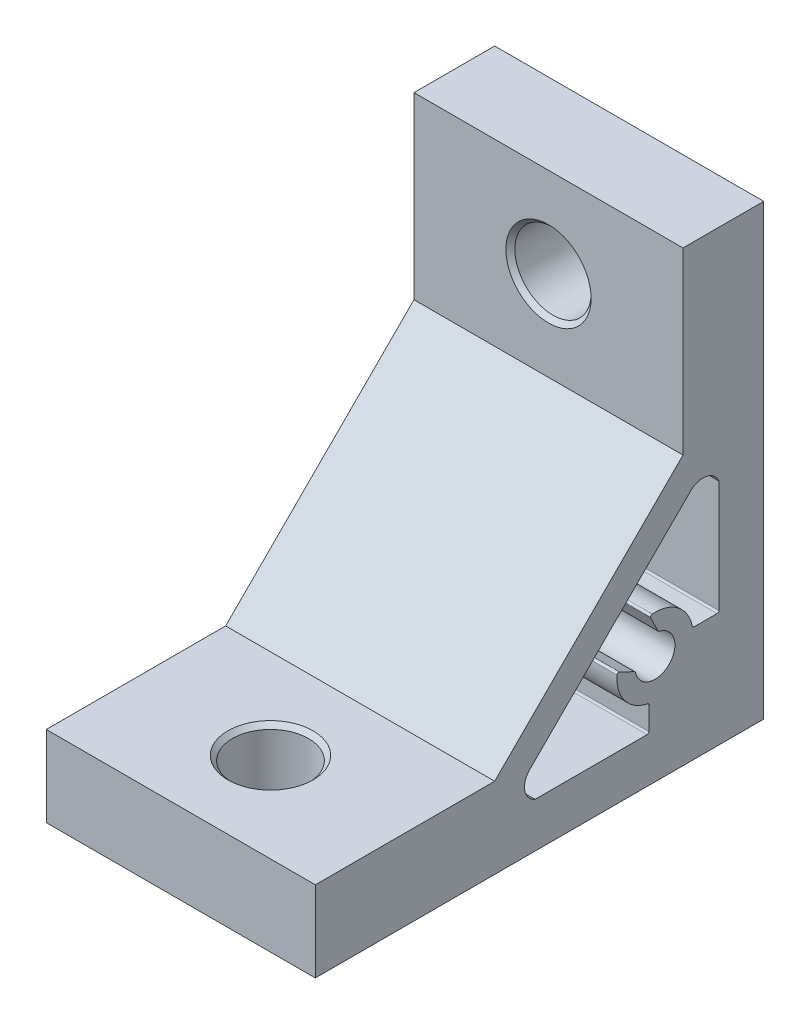
ISO-10303-21;
HEADER;
FILE_DESCRIPTION(('STEP AP214'),'2;1');
FILE_NAME('part.step','',(''),(''),'','','');
FILE_SCHEMA(('AUTOMOTIVE_DESIGN { 1 0 10303 214 1 1 1 1 }'));
ENDSEC;
DATA;
#1=APPLICATION_CONTEXT('core data for automotive mechanical design processes');
#2=APPLICATION_PROTOCOL_DEFINITION('international standard','automotive_design',2000,#1);
#3=PRODUCT_CONTEXT('',#1,'mechanical');
#4=PRODUCT('Part','Part','',(#3));
#5=PRODUCT_RELATED_PRODUCT_CATEGORY('part','',(#4));
#6=PRODUCT_DEFINITION_FORMATION('','',#4);
#7=PRODUCT_DEFINITION_CONTEXT('part definition',#1,'design');
#8=PRODUCT_DEFINITION('design','',#6,#7);
#9=PRODUCT_DEFINITION_SHAPE('','',#8);
#10=(LENGTH_UNIT() NAMED_UNIT(*) SI_UNIT(.MILLI.,.METRE.));
#11=(NAMED_UNIT(*) PLANE_ANGLE_UNIT() SI_UNIT($,.RADIAN.));
#12=(NAMED_UNIT(*) SI_UNIT($,.STERADIAN.) SOLID_ANGLE_UNIT());
#13=UNCERTAINTY_MEASURE_WITH_UNIT(LENGTH_MEASURE(1.E-05),#10,'distance_accuracy_value','');
#14=(GEOMETRIC_REPRESENTATION_CONTEXT(3) GLOBAL_UNCERTAINTY_ASSIGNED_CONTEXT((#13)) GLOBAL_UNIT_ASSIGNED_CONTEXT((#10,
#11,#12)) REPRESENTATION_CONTEXT('',''));
#15=CARTESIAN_POINT('',(0.,0.,0.));
#16=DIRECTION('',(0.,0.,1.));
#17=DIRECTION('',(1.,0.,0.));
#18=AXIS2_PLACEMENT_3D('',#15,#16,#17);
#19=CARTESIAN_POINT('',(15.730337766214,-14.5646423427639,24.6997902439944));
#20=DIRECTION('',(0.,0.,-1.));
#21=DIRECTION('',(0.,1.,0.));
#22=AXIS2_PLACEMENT_3D('',#19,#20,#21);
#23=PLANE('',#22);
#24=DIRECTION('',(0.,-1.,0.));
#25=VECTOR('',#24,1.);
#26=CARTESIAN_POINT('',(-14.269662233786,-14.5646423427639,24.6997902439944));
#27=LINE('',#26,#25);
#28=CARTESIAN_POINT('',(-14.269662233786,-14.5646423427639,24.6997902439944));
#29=VERTEX_POINT('',#28);
#30=CARTESIAN_POINT('',(-14.269662233786,-23.5646423427639,24.6997902439944));
#31=VERTEX_POINT('',#30);
#32=EDGE_CURVE('E280',#29,#31,#27,.T.);
#33=ORIENTED_EDGE('',*,*,#32,.T.);
#34=DIRECTION('',(-1.,0.,0.));
#35=VECTOR('',#34,1.);
#36=CARTESIAN_POINT('',(15.730337766214,-23.5646423427639,24.6997902439944));
#37=LINE('',#36,#35);
#38=CARTESIAN_POINT('',(15.730337766214,-23.5646423427639,24.6997902439944));
#39=VERTEX_POINT('',#38);
#40=EDGE_CURVE('E331',#39,#31,#37,.T.);
#41=ORIENTED_EDGE('',*,*,#40,.F.);
#42=DIRECTION('',(0.,-1.,0.));
#43=VECTOR('',#42,1.);
#44=CARTESIAN_POINT('',(15.730337766214,-14.5646423427639,24.6997902439944));
#45=LINE('',#44,#43);
#46=CARTESIAN_POINT('',(15.730337766214,-14.5646423427639,24.6997902439944));
#47=VERTEX_POINT('',#46);
#48=EDGE_CURVE('E284',#47,#39,#45,.T.);
#49=ORIENTED_EDGE('',*,*,#48,.F.);
#50=DIRECTION('',(-1.,0.,0.));
#51=VECTOR('',#50,1.);
#52=CARTESIAN_POINT('',(15.730337766214,-14.5646423427639,24.6997902439944));
#53=LINE('',#52,#51);
#54=EDGE_CURVE('E300',#47,#29,#53,.T.);
#55=ORIENTED_EDGE('',*,*,#54,.T.);
#56=EDGE_LOOP('',(#33,#41,#49,#55));
#57=FACE_BOUND('',#56,.T.);
#58=ADVANCED_FACE('F16',(#57),#23,.F.);
#59=CARTESIAN_POINT('',(15.730337766214,-23.5646423427639,24.6997902439944));
#60=DIRECTION('',(0.,1.,0.));
#61=DIRECTION('',(0.,0.,1.));
#62=AXIS2_PLACEMENT_3D('',#59,#60,#61);
#63=PLANE('',#62);
#64=CARTESIAN_POINT('',(0.73033776621401,-23.5646423427639,14.6997902439944));
#65=DIRECTION('',(0.,1.,0.));
#66=DIRECTION('',(0.,0.,1.));
#67=AXIS2_PLACEMENT_3D('',#64,#65,#66);
#68=CIRCLE('',#67,4.74999999999998);
#69=CARTESIAN_POINT('',(0.73033776621401,-23.5646423427639,19.4497902439943));
#70=VERTEX_POINT('',#69);
#71=EDGE_CURVE('E334',#70,#70,#68,.T.);
#72=ORIENTED_EDGE('',*,*,#71,.T.);
#73=EDGE_LOOP('',(#72));
#74=FACE_BOUND('',#73,.T.);
#75=DIRECTION('',(0.,0.,-1.));
#76=VECTOR('',#75,1.);
#77=CARTESIAN_POINT('',(-14.269662233786,-23.5646423427639,24.6997902439944));
#78=LINE('',#77,#76);
#79=CARTESIAN_POINT('',(-14.269662233786,-23.5646423427639,-25.3002097560056));
#80=VERTEX_POINT('',#79);
#81=EDGE_CURVE('E303',#31,#80,#78,.T.);
#82=ORIENTED_EDGE('',*,*,#81,.T.);
#83=DIRECTION('',(-1.,0.,0.));
#84=VECTOR('',#83,1.);
#85=CARTESIAN_POINT('',(15.730337766214,-23.5646423427639,-25.3002097560056));
#86=LINE('',#85,#84);
#87=CARTESIAN_POINT('',(15.730337766214,-23.5646423427639,-25.3002097560056));
#88=VERTEX_POINT('',#87);
#89=EDGE_CURVE('E328',#88,#80,#86,.T.);
#90=ORIENTED_EDGE('',*,*,#89,.F.);
#91=DIRECTION('',(0.,0.,-1.));
#92=VECTOR('',#91,1.);
#93=CARTESIAN_POINT('',(15.730337766214,-23.5646423427639,24.6997902439944));
#94=LINE('',#93,#92);
#95=EDGE_CURVE('E287',#39,#88,#94,.T.);
#96=ORIENTED_EDGE('',*,*,#95,.F.);
#97=ORIENTED_EDGE('',*,*,#40,.T.);
#98=EDGE_LOOP('',(#82,#90,#96,#97));
#99=FACE_BOUND('',#98,.T.);
#100=ADVANCED_FACE('F504',(#74,#99),#63,.F.);
#101=CARTESIAN_POINT('',(15.730337766214,-23.5646423427639,-25.3002097560056));
#102=DIRECTION('',(0.,0.,1.));
#103=DIRECTION('',(0.,-1.,0.));
#104=AXIS2_PLACEMENT_3D('',#101,#102,#103);
#105=PLANE('',#104);
#106=CARTESIAN_POINT('',(0.730337766214012,16.4353576572361,-25.3002097560056));
#107=DIRECTION('',(0.,0.,1.));
#108=DIRECTION('',(0.,-1.,0.));
#109=AXIS2_PLACEMENT_3D('',#106,#107,#108);
#110=CIRCLE('',#109,4.74999999999999);
#111=CARTESIAN_POINT('',(0.730337766214012,11.6853576572361,-25.3002097560056));
#112=VERTEX_POINT('',#111);
#113=EDGE_CURVE('E343',#112,#112,#110,.T.);
#114=ORIENTED_EDGE('',*,*,#113,.T.);
#115=EDGE_LOOP('',(#114));
#116=FACE_BOUND('',#115,.T.);
#117=DIRECTION('',(0.,1.,0.));
#118=VECTOR('',#117,1.);
#119=CARTESIAN_POINT('',(-14.269662233786,-23.5646423427639,-25.3002097560056));
#120=LINE('',#119,#118);
#121=CARTESIAN_POINT('',(-14.269662233786,26.4353576572361,-25.3002097560056));
#122=VERTEX_POINT('',#121);
#123=EDGE_CURVE('E305',#80,#122,#120,.T.);
#124=ORIENTED_EDGE('',*,*,#123,.T.);
#125=DIRECTION('',(-1.,0.,0.));
#126=VECTOR('',#125,1.);
#127=CARTESIAN_POINT('',(15.730337766214,26.4353576572361,-25.3002097560056));
#128=LINE('',#127,#126);
#129=CARTESIAN_POINT('',(15.730337766214,26.4353576572361,-25.3002097560056));
#130=VERTEX_POINT('',#129);
#131=EDGE_CURVE('E325',#130,#122,#128,.T.);
#132=ORIENTED_EDGE('',*,*,#131,.F.);
#133=DIRECTION('',(0.,1.,0.));
#134=VECTOR('',#133,1.);
#135=CARTESIAN_POINT('',(15.730337766214,-23.5646423427639,-25.3002097560056));
#136=LINE('',#135,#134);
#137=EDGE_CURVE('E290',#88,#130,#136,.T.);
#138=ORIENTED_EDGE('',*,*,#137,.F.);
#139=ORIENTED_EDGE('',*,*,#89,.T.);
#140=EDGE_LOOP('',(#124,#132,#138,#139));
#141=FACE_BOUND('',#140,.T.);
#142=ADVANCED_FACE('F510',(#116,#141),#105,.F.);
#143=CARTESIAN_POINT('',(15.730337766214,26.4353576572361,-25.3002097560056));
#144=DIRECTION('',(0.,-1.,0.));
#145=DIRECTION('',(0.,0.,-1.));
#146=AXIS2_PLACEMENT_3D('',#143,#144,#145);
#147=PLANE('',#146);
#148=DIRECTION('',(0.,0.,1.));
#149=VECTOR('',#148,1.);
#150=CARTESIAN_POINT('',(-14.269662233786,26.4353576572361,-25.3002097560056));
#151=LINE('',#150,#149);
#152=CARTESIAN_POINT('',(-14.269662233786,26.4353576572361,-16.3002097560056));
#153=VERTEX_POINT('',#152);
#154=EDGE_CURVE('E307',#122,#153,#151,.T.);
#155=ORIENTED_EDGE('',*,*,#154,.T.);
#156=DIRECTION('',(-1.,0.,0.));
#157=VECTOR('',#156,1.);
#158=CARTESIAN_POINT('',(15.730337766214,26.4353576572361,-16.3002097560056));
#159=LINE('',#158,#157);
#160=CARTESIAN_POINT('',(15.730337766214,26.4353576572361,-16.3002097560056));
#161=VERTEX_POINT('',#160);
#162=EDGE_CURVE('E322',#161,#153,#159,.T.);
#163=ORIENTED_EDGE('',*,*,#162,.F.);
#164=DIRECTION('',(0.,0.,1.));
#165=VECTOR('',#164,1.);
#166=CARTESIAN_POINT('',(15.730337766214,26.4353576572361,-25.3002097560056));
#167=LINE('',#166,#165);
#168=EDGE_CURVE('E292',#130,#161,#167,.T.);
#169=ORIENTED_EDGE('',*,*,#168,.F.);
#170=ORIENTED_EDGE('',*,*,#131,.T.);
#171=EDGE_LOOP('',(#155,#163,#169,#170));
#172=FACE_BOUND('',#171,.T.);
#173=ADVANCED_FACE('F753',(#172),#147,.F.);
#174=CARTESIAN_POINT('',(15.730337766214,26.4353576572361,-16.3002097560056));
#175=DIRECTION('',(0.,0.,-1.));
#176=DIRECTION('',(0.,1.,0.));
#177=AXIS2_PLACEMENT_3D('',#174,#175,#176);
#178=PLANE('',#177);
#179=CARTESIAN_POINT('',(0.730337766214012,16.4353576572361,-16.3002097560056));
#180=DIRECTION('',(0.,0.,-1.));
#181=DIRECTION('',(0.,1.,0.));
#182=AXIS2_PLACEMENT_3D('',#179,#180,#181);
#183=CIRCLE('',#182,4.75000000000004);
#184=CARTESIAN_POINT('',(0.730337766214012,21.1853576572362,-16.3002097560056));
#185=VERTEX_POINT('',#184);
#186=EDGE_CURVE('E355',#185,#185,#183,.T.);
#187=ORIENTED_EDGE('',*,*,#186,.T.);
#188=EDGE_LOOP('',(#187));
#189=FACE_BOUND('',#188,.T.);
#190=DIRECTION('',(0.,-1.,0.));
#191=VECTOR('',#190,1.);
#192=CARTESIAN_POINT('',(-14.269662233786,26.4353576572361,-16.3002097560056));
#193=LINE('',#192,#191);
#194=CARTESIAN_POINT('',(-14.269662233786,6.43535765723613,-16.3002097560056));
#195=VERTEX_POINT('',#194);
#196=EDGE_CURVE('E309',#153,#195,#193,.T.);
#197=ORIENTED_EDGE('',*,*,#196,.T.);
#198=DIRECTION('',(-1.,0.,0.));
#199=VECTOR('',#198,1.);
#200=CARTESIAN_POINT('',(15.730337766214,6.43535765723613,-16.3002097560056));
#201=LINE('',#200,#199);
#202=CARTESIAN_POINT('',(15.730337766214,6.43535765723613,-16.3002097560056));
#203=VERTEX_POINT('',#202);
#204=EDGE_CURVE('E319',#203,#195,#201,.T.);
#205=ORIENTED_EDGE('',*,*,#204,.F.);
#206=DIRECTION('',(0.,-1.,0.));
#207=VECTOR('',#206,1.);
#208=CARTESIAN_POINT('',(15.730337766214,26.4353576572361,-16.3002097560056));
#209=LINE('',#208,#207);
#210=EDGE_CURVE('E294',#161,#203,#209,.T.);
#211=ORIENTED_EDGE('',*,*,#210,.F.);
#212=ORIENTED_EDGE('',*,*,#162,.T.);
#213=EDGE_LOOP('',(#197,#205,#211,#212));
#214=FACE_BOUND('',#213,.T.);
#215=ADVANCED_FACE('F744',(#189,#214),#178,.F.);
#216=CARTESIAN_POINT('',(15.730337766214,6.43535765723613,-16.3002097560056));
#217=DIRECTION('',(0.,-0.707106781186547,-0.707106781186548));
#218=DIRECTION('',(0.,0.707106781186548,-0.707106781186547));
#219=AXIS2_PLACEMENT_3D('',#216,#217,#218);
#220=PLANE('',#219);
#221=DIRECTION('',(0.,-0.707106781186548,0.707106781186547));
#222=VECTOR('',#221,1.);
#223=CARTESIAN_POINT('',(-14.269662233786,6.43535765723613,-16.3002097560056));
#224=LINE('',#223,#222);
#225=CARTESIAN_POINT('',(-14.269662233786,-14.5646423427639,4.69979024399435));
#226=VERTEX_POINT('',#225);
#227=EDGE_CURVE('E311',#195,#226,#224,.T.);
#228=ORIENTED_EDGE('',*,*,#227,.T.);
#229=DIRECTION('',(-1.,0.,0.));
#230=VECTOR('',#229,1.);
#231=CARTESIAN_POINT('',(15.730337766214,-14.5646423427639,4.69979024399435));
#232=LINE('',#231,#230);
#233=CARTESIAN_POINT('',(15.730337766214,-14.5646423427639,4.69979024399435));
#234=VERTEX_POINT('',#233);
#235=EDGE_CURVE('E316',#234,#226,#232,.T.);
#236=ORIENTED_EDGE('',*,*,#235,.F.);
#237=DIRECTION('',(0.,-0.707106781186548,0.707106781186547));
#238=VECTOR('',#237,1.);
#239=CARTESIAN_POINT('',(15.730337766214,6.43535765723613,-16.3002097560056));
#240=LINE('',#239,#238);
#241=EDGE_CURVE('E296',#203,#234,#240,.T.);
#242=ORIENTED_EDGE('',*,*,#241,.F.);
#243=ORIENTED_EDGE('',*,*,#204,.T.);
#244=EDGE_LOOP('',(#228,#236,#242,#243));
#245=FACE_BOUND('',#244,.T.);
#246=ADVANCED_FACE('F735',(#245),#220,.F.);
#247=CARTESIAN_POINT('',(15.730337766214,-14.5646423427639,4.69979024399435));
#248=DIRECTION('',(0.,-1.,0.));
#249=DIRECTION('',(0.,0.,-1.));
#250=AXIS2_PLACEMENT_3D('',#247,#248,#249);
#251=PLANE('',#250);
#252=CARTESIAN_POINT('',(0.73033776621401,-14.5646423427639,14.6997902439944));
#253=DIRECTION('',(0.,-1.,0.));
#254=DIRECTION('',(0.,0.,-1.));
#255=AXIS2_PLACEMENT_3D('',#252,#253,#254);
#256=CIRCLE('',#255,4.74999999999999);
#257=CARTESIAN_POINT('',(0.73033776621401,-14.5646423427639,9.94979024399436));
#258=VERTEX_POINT('',#257);
#259=EDGE_CURVE('E352',#258,#258,#256,.T.);
#260=ORIENTED_EDGE('',*,*,#259,.T.);
#261=EDGE_LOOP('',(#260));
#262=FACE_BOUND('',#261,.T.);
#263=DIRECTION('',(0.,0.,1.));
#264=VECTOR('',#263,1.);
#265=CARTESIAN_POINT('',(-14.269662233786,-14.5646423427639,4.69979024399435));
#266=LINE('',#265,#264);
#267=EDGE_CURVE('E288',#226,#29,#266,.T.);
#268=ORIENTED_EDGE('',*,*,#267,.T.);
#269=ORIENTED_EDGE('',*,*,#54,.F.);
#270=DIRECTION('',(0.,0.,1.));
#271=VECTOR('',#270,1.);
#272=CARTESIAN_POINT('',(15.730337766214,-14.5646423427639,4.69979024399435));
#273=LINE('',#272,#271);
#274=EDGE_CURVE('E298',#234,#47,#273,.T.);
#275=ORIENTED_EDGE('',*,*,#274,.F.);
#276=ORIENTED_EDGE('',*,*,#235,.T.);
#277=EDGE_LOOP('',(#268,#269,#275,#276));
#278=FACE_BOUND('',#277,.T.);
#279=ADVANCED_FACE('F727',(#262,#278),#251,.F.);
#280=CARTESIAN_POINT('',(15.730337766214,-23.5646423427639,-0.300209756005643));
#281=DIRECTION('',(1.,0.,0.));
#282=DIRECTION('',(0.,0.,-1.));
#283=AXIS2_PLACEMENT_3D('',#280,#281,#282);
#284=PLANE('',#283);
#285=DIRECTION('',(0.,-0.441188575542835,-0.897414419769642));
#286=VECTOR('',#285,1.);
#287=CARTESIAN_POINT('',(15.730337766214,-11.8278844515461,-10.982512113457));
#288=LINE('',#287,#286);
#289=CARTESIAN_POINT('',(15.730337766214,-10.9623868313826,-9.22201764993785));
#290=VERTEX_POINT('',#289);
#291=CARTESIAN_POINT('',(15.730337766214,-11.7843981004198,-10.8940572423944));
#292=VERTEX_POINT('',#291);
#293=EDGE_CURVE('E265',#290,#292,#288,.T.);
#294=ORIENTED_EDGE('',*,*,#293,.F.);
#295=CARTESIAN_POINT('',(15.730337766214,-11.1418697153365,-9.13377993482929));
#296=DIRECTION('',(1.,0.,0.));
#297=DIRECTION('',(0.,0.,-1.));
#298=AXIS2_PLACEMENT_3D('',#295,#296,#297);
#299=CIRCLE('',#298,0.2);
#300=CARTESIAN_POINT('',(15.730337766214,-11.1272749074084,-8.93431316671605));
#301=VERTEX_POINT('',#300);
#302=EDGE_CURVE('E389',#290,#301,#299,.T.);
#303=ORIENTED_EDGE('',*,*,#302,.T.);
#304=CARTESIAN_POINT('',(15.730337766214,-11.4374145758807,-13.1729819891224));
#305=DIRECTION('',(-1.,0.,0.));
#306=DIRECTION('',(0.,0.,-1.));
#307=AXIS2_PLACEMENT_3D('',#304,#305,#306);
#308=CIRCLE('',#307,4.25);
#309=CARTESIAN_POINT('',(15.730337766214,-15.605844136095,-12.344311366057));
#310=VERTEX_POINT('',#309);
#311=EDGE_CURVE('E262',#310,#301,#308,.T.);
#312=ORIENTED_EDGE('',*,*,#311,.F.);
#313=CARTESIAN_POINT('',(15.730337766214,-15.8020055271639,-12.3053151014422));
#314=DIRECTION('',(1.,0.,0.));
#315=DIRECTION('',(0.,0.,-1.));
#316=AXIS2_PLACEMENT_3D('',#313,#314,#315);
#317=CIRCLE('',#316,0.2);
#318=CARTESIAN_POINT('',(15.730337766214,-15.8020055271639,-12.5053151014422));
#319=VERTEX_POINT('',#318);
#320=EDGE_CURVE('E420',#310,#319,#317,.F.);
#321=ORIENTED_EDGE('',*,*,#320,.T.);
#322=DIRECTION('',(0.,1.,0.));
#323=VECTOR('',#322,1.);
#324=CARTESIAN_POINT('',(15.730337766214,-18.5646423427639,-12.5053151014422));
#325=LINE('',#324,#323);
#326=CARTESIAN_POINT('',(15.730337766214,-18.3646423427639,-12.5053151014422));
#327=VERTEX_POINT('',#326);
#328=EDGE_CURVE('E259',#327,#319,#325,.T.);
#329=ORIENTED_EDGE('',*,*,#328,.F.);
#330=CARTESIAN_POINT('',(15.730337766214,-18.3646423427639,-12.3053151014422));
#331=DIRECTION('',(1.,0.,0.));
#332=DIRECTION('',(0.,0.,-1.));
#333=AXIS2_PLACEMENT_3D('',#330,#331,#332);
#334=CIRCLE('',#333,0.2);
#335=CARTESIAN_POINT('',(15.730337766214,-18.5646423427639,-12.3053151014422));
#336=VERTEX_POINT('',#335);
#337=EDGE_CURVE('E416',#327,#336,#334,.F.);
#338=ORIENTED_EDGE('',*,*,#337,.T.);
#339=DIRECTION('',(0.,0.,-1.));
#340=VECTOR('',#339,1.);
#341=CARTESIAN_POINT('',(15.730337766214,-18.5646423427639,0.194684898557791));
#342=LINE('',#341,#340);
#343=CARTESIAN_POINT('',(15.730337766214,-18.5646423427639,0.194684898557796));
#344=VERTEX_POINT('',#343);
#345=EDGE_CURVE('E256',#344,#336,#342,.T.);
#346=ORIENTED_EDGE('',*,*,#345,.F.);
#347=CARTESIAN_POINT('',(15.730337766214,-16.7817970669112,-0.556852238014705));
#348=DIRECTION('',(1.,0.,0.));
#349=DIRECTION('',(0.,0.,-1.));
#350=AXIS2_PLACEMENT_3D('',#347,#348,#349);
#351=CIRCLE('',#350,1.93477268568628);
#352=CARTESIAN_POINT('',(15.730337766214,-15.413706180808,0.811238648088585));
#353=VERTEX_POINT('',#352);
#354=EDGE_CURVE('E253',#353,#344,#351,.T.);
#355=ORIENTED_EDGE('',*,*,#354,.F.);
#356=DIRECTION('',(0.,-0.707106781186547,0.707106781186548));
#357=VECTOR('',#356,1.);
#358=CARTESIAN_POINT('',(15.730337766214,-15.413706180808,0.811238648088585));
#359=LINE('',#358,#357);
#360=CARTESIAN_POINT('',(15.730337766214,2.54680606133035,-17.1492735940497));
#361=VERTEX_POINT('',#360);
#362=EDGE_CURVE('E251',#361,#353,#359,.T.);
#363=ORIENTED_EDGE('',*,*,#362,.F.);
#364=CARTESIAN_POINT('',(15.730337766214,1.17871517522708,-18.517364480153));
#365=DIRECTION('',(1.,0.,0.));
#366=DIRECTION('',(0.,0.,1.));
#367=AXIS2_PLACEMENT_3D('',#364,#365,#366);
#368=CIRCLE('',#367,1.93477268568627);
#369=CARTESIAN_POINT('',(15.730337766214,1.93025231179957,-20.3002097560056));
#370=VERTEX_POINT('',#369);
#371=EDGE_CURVE('E203',#370,#361,#368,.T.);
#372=ORIENTED_EDGE('',*,*,#371,.F.);
#373=DIRECTION('',(0.,1.,0.));
#374=VECTOR('',#373,1.);
#375=CARTESIAN_POINT('',(15.730337766214,1.93025231179957,-20.3002097560056));
#376=LINE('',#375,#374);
#377=CARTESIAN_POINT('',(15.730337766214,-10.5697476882004,-20.3002097560056));
#378=VERTEX_POINT('',#377);
#379=EDGE_CURVE('E222',#378,#370,#376,.T.);
#380=ORIENTED_EDGE('',*,*,#379,.F.);
#381=CARTESIAN_POINT('',(15.730337766214,-10.5697476882004,-20.1002097560056));
#382=DIRECTION('',(1.,0.,0.));
#383=DIRECTION('',(0.,0.,-1.));
#384=AXIS2_PLACEMENT_3D('',#381,#382,#383);
#385=CIRCLE('',#384,0.2);
#386=CARTESIAN_POINT('',(15.730337766214,-10.7697476882004,-20.1002097560056));
#387=VERTEX_POINT('',#386);
#388=EDGE_CURVE('E412',#378,#387,#385,.F.);
#389=ORIENTED_EDGE('',*,*,#388,.T.);
#390=DIRECTION('',(0.,0.,-1.));
#391=VECTOR('',#390,1.);
#392=CARTESIAN_POINT('',(15.730337766214,-10.7697476882004,-20.3002097560056));
#393=LINE('',#392,#391);
#394=CARTESIAN_POINT('',(15.730337766214,-10.7697476882004,-17.5375729404056));
#395=VERTEX_POINT('',#394);
#396=EDGE_CURVE('E224',#395,#387,#393,.T.);
#397=ORIENTED_EDGE('',*,*,#396,.F.);
#398=CARTESIAN_POINT('',(15.730337766214,-10.5697476882004,-17.5375729404056));
#399=DIRECTION('',(1.,0.,0.));
#400=DIRECTION('',(0.,0.,-1.));
#401=AXIS2_PLACEMENT_3D('',#398,#399,#400);
#402=CIRCLE('',#401,0.2);
#403=CARTESIAN_POINT('',(15.730337766214,-10.6087439528153,-17.3414115493367));
#404=VERTEX_POINT('',#403);
#405=EDGE_CURVE('E24',#395,#404,#402,.F.);
#406=ORIENTED_EDGE('',*,*,#405,.T.);
#407=CARTESIAN_POINT('',(15.730337766214,-11.4374145758807,-13.1729819891224));
#408=DIRECTION('',(-1.,0.,0.));
#409=DIRECTION('',(0.,0.,-1.));
#410=AXIS2_PLACEMENT_3D('',#407,#408,#409);
#411=CIRCLE('',#410,4.25);
#412=CARTESIAN_POINT('',(15.730337766214,-7.19874575347427,-12.8628423206502));
#413=VERTEX_POINT('',#412);
#414=EDGE_CURVE('E274',#413,#404,#411,.T.);
#415=ORIENTED_EDGE('',*,*,#414,.F.);
#416=CARTESIAN_POINT('',(15.730337766214,-7.39821252158751,-12.8774371285783));
#417=DIRECTION('',(1.,0.,0.));
#418=DIRECTION('',(0.,0.,-1.));
#419=AXIS2_PLACEMENT_3D('',#416,#417,#418);
#420=CIRCLE('',#419,0.2);
#421=CARTESIAN_POINT('',(15.730337766214,-7.48645023669608,-12.6979542446244));
#422=VERTEX_POINT('',#421);
#423=EDGE_CURVE('E383',#413,#422,#420,.T.);
#424=ORIENTED_EDGE('',*,*,#423,.T.);
#425=DIRECTION('',(0.,0.897414419769642,0.441188575542837));
#426=VECTOR('',#425,1.);
#427=CARTESIAN_POINT('',(15.730337766214,-9.24694470021522,-13.5634518647879));
#428=LINE('',#427,#426);
#429=CARTESIAN_POINT('',(15.730337766214,-9.15848982915261,-13.5199655136616));
#430=VERTEX_POINT('',#429);
#431=EDGE_CURVE('E271',#430,#422,#428,.T.);
#432=ORIENTED_EDGE('',*,*,#431,.F.);
#433=CARTESIAN_POINT('',(15.730337766214,-9.07025211404404,-13.6994483976155));
#434=DIRECTION('',(1.,0.,0.));
#435=DIRECTION('',(0.,0.,-1.));
#436=AXIS2_PLACEMENT_3D('',#433,#434,#435);
#437=CIRCLE('',#436,0.2);
#438=CARTESIAN_POINT('',(15.730337766214,-9.26548200780376,-13.6560284876367));
#439=VERTEX_POINT('',#438);
#440=EDGE_CURVE('E385',#430,#439,#437,.T.);
#441=ORIENTED_EDGE('',*,*,#440,.T.);
#442=CARTESIAN_POINT('',(15.730337766214,-11.4374145758807,-13.1729819891224));
#443=DIRECTION('',(1.,0.,0.));
#444=DIRECTION('',(0.,0.,-1.));
#445=AXIS2_PLACEMENT_3D('',#442,#443,#444);
#446=CIRCLE('',#445,2.22499999999999);
#447=CARTESIAN_POINT('',(15.730337766214,-11.9204610743949,-11.0010494210455));
#448=VERTEX_POINT('',#447);
#449=EDGE_CURVE('E268',#448,#439,#446,.T.);
#450=ORIENTED_EDGE('',*,*,#449,.F.);
#451=CARTESIAN_POINT('',(15.730337766214,-11.9638809843737,-10.8058195272858));
#452=DIRECTION('',(1.,0.,0.));
#453=DIRECTION('',(0.,0.,-1.));
#454=AXIS2_PLACEMENT_3D('',#451,#452,#453);
#455=CIRCLE('',#454,0.2);
#456=EDGE_CURVE('E387',#448,#292,#455,.T.);
#457=ORIENTED_EDGE('',*,*,#456,.T.);
#458=EDGE_LOOP('',(#294,#303,#312,#321,#329,#338,#346,#355,#363,#372,#380,#389,#397,#406,#415,
#424,#432,#441,#450,#457));
#459=FACE_BOUND('',#458,.T.);
#460=ORIENTED_EDGE('',*,*,#48,.T.);
#461=ORIENTED_EDGE('',*,*,#95,.T.);
#462=ORIENTED_EDGE('',*,*,#137,.T.);
#463=ORIENTED_EDGE('',*,*,#168,.T.);
#464=ORIENTED_EDGE('',*,*,#210,.T.);
#465=ORIENTED_EDGE('',*,*,#241,.T.);
#466=ORIENTED_EDGE('',*,*,#274,.T.);
#467=EDGE_LOOP('',(#460,#461,#462,#463,#464,#465,#466));
#468=FACE_BOUND('',#467,.T.);
#469=ADVANCED_FACE('F427',(#459,#468),#284,.T.);
#470=CARTESIAN_POINT('',(-14.269662233786,-23.5646423427639,-0.300209756005643));
#471=DIRECTION('',(1.,0.,0.));
#472=DIRECTION('',(0.,0.,-1.));
#473=AXIS2_PLACEMENT_3D('',#470,#471,#472);
#474=PLANE('',#473);
#475=CARTESIAN_POINT('',(-14.269662233786,-11.4374145758807,-13.1729819891224));
#476=DIRECTION('',(-1.,0.,0.));
#477=DIRECTION('',(0.,0.,-1.));
#478=AXIS2_PLACEMENT_3D('',#475,#476,#477);
#479=CIRCLE('',#478,4.25);
#480=CARTESIAN_POINT('',(-14.269662233786,-15.605844136095,-12.344311366057));
#481=VERTEX_POINT('',#480);
#482=CARTESIAN_POINT('',(-14.269662233786,-11.1272749074084,-8.93431316671605));
#483=VERTEX_POINT('',#482);
#484=EDGE_CURVE('E234',#481,#483,#479,.T.);
#485=ORIENTED_EDGE('',*,*,#484,.T.);
#486=CARTESIAN_POINT('',(-14.269662233786,-11.1418697153365,-9.13377993482929));
#487=DIRECTION('',(1.,0.,0.));
#488=DIRECTION('',(0.,0.,-1.));
#489=AXIS2_PLACEMENT_3D('',#486,#487,#488);
#490=CIRCLE('',#489,0.2);
#491=CARTESIAN_POINT('',(-14.269662233786,-10.9623868313826,-9.22201764993785));
#492=VERTEX_POINT('',#491);
#493=EDGE_CURVE('E396',#483,#492,#490,.F.);
#494=ORIENTED_EDGE('',*,*,#493,.T.);
#495=DIRECTION('',(0.,-0.441188575542835,-0.897414419769642));
#496=VECTOR('',#495,1.);
#497=CARTESIAN_POINT('',(-14.269662233786,-11.8278844515461,-10.982512113457));
#498=LINE('',#497,#496);
#499=CARTESIAN_POINT('',(-14.269662233786,-11.7843981004198,-10.8940572423944));
#500=VERTEX_POINT('',#499);
#501=EDGE_CURVE('E236',#492,#500,#498,.T.);
#502=ORIENTED_EDGE('',*,*,#501,.T.);
#503=CARTESIAN_POINT('',(-14.269662233786,-11.9638809843737,-10.8058195272858));
#504=DIRECTION('',(1.,0.,0.));
#505=DIRECTION('',(0.,0.,-1.));
#506=AXIS2_PLACEMENT_3D('',#503,#504,#505);
#507=CIRCLE('',#506,0.2);
#508=CARTESIAN_POINT('',(-14.269662233786,-11.9204610743949,-11.0010494210455));
#509=VERTEX_POINT('',#508);
#510=EDGE_CURVE('E394',#500,#509,#507,.F.);
#511=ORIENTED_EDGE('',*,*,#510,.T.);
#512=CARTESIAN_POINT('',(-14.269662233786,-11.4374145758807,-13.1729819891224));
#513=DIRECTION('',(1.,0.,0.));
#514=DIRECTION('',(0.,0.,-1.));
#515=AXIS2_PLACEMENT_3D('',#512,#513,#514);
#516=CIRCLE('',#515,2.22499999999999);
#517=CARTESIAN_POINT('',(-14.269662233786,-9.26548200780376,-13.6560284876367));
#518=VERTEX_POINT('',#517);
#519=EDGE_CURVE('E239',#509,#518,#516,.T.);
#520=ORIENTED_EDGE('',*,*,#519,.T.);
#521=CARTESIAN_POINT('',(-14.269662233786,-9.07025211404404,-13.6994483976155));
#522=DIRECTION('',(1.,0.,0.));
#523=DIRECTION('',(0.,0.,-1.));
#524=AXIS2_PLACEMENT_3D('',#521,#522,#523);
#525=CIRCLE('',#524,0.2);
#526=CARTESIAN_POINT('',(-14.269662233786,-9.15848982915261,-13.5199655136616));
#527=VERTEX_POINT('',#526);
#528=EDGE_CURVE('E392',#518,#527,#525,.F.);
#529=ORIENTED_EDGE('',*,*,#528,.T.);
#530=DIRECTION('',(0.,0.897414419769642,0.441188575542837));
#531=VECTOR('',#530,1.);
#532=CARTESIAN_POINT('',(-14.269662233786,-9.24694470021522,-13.5634518647879));
#533=LINE('',#532,#531);
#534=CARTESIAN_POINT('',(-14.269662233786,-7.48645023669608,-12.6979542446244));
#535=VERTEX_POINT('',#534);
#536=EDGE_CURVE('E242',#527,#535,#533,.T.);
#537=ORIENTED_EDGE('',*,*,#536,.T.);
#538=CARTESIAN_POINT('',(-14.269662233786,-7.39821252158751,-12.8774371285783));
#539=DIRECTION('',(1.,0.,0.));
#540=DIRECTION('',(0.,0.,-1.));
#541=AXIS2_PLACEMENT_3D('',#538,#539,#540);
#542=CIRCLE('',#541,0.2);
#543=CARTESIAN_POINT('',(-14.269662233786,-7.19874575347427,-12.8628423206502));
#544=VERTEX_POINT('',#543);
#545=EDGE_CURVE('E38',#535,#544,#542,.F.);
#546=ORIENTED_EDGE('',*,*,#545,.T.);
#547=CARTESIAN_POINT('',(-14.269662233786,-11.4374145758807,-13.1729819891224));
#548=DIRECTION('',(-1.,0.,0.));
#549=DIRECTION('',(0.,0.,-1.));
#550=AXIS2_PLACEMENT_3D('',#547,#548,#549);
#551=CIRCLE('',#550,4.25);
#552=CARTESIAN_POINT('',(-14.269662233786,-10.6087439528153,-17.3414115493367));
#553=VERTEX_POINT('',#552);
#554=EDGE_CURVE('E244',#544,#553,#551,.T.);
#555=ORIENTED_EDGE('',*,*,#554,.T.);
#556=CARTESIAN_POINT('',(-14.269662233786,-10.5697476882004,-17.5375729404056));
#557=DIRECTION('',(1.,0.,0.));
#558=DIRECTION('',(0.,0.,-1.));
#559=AXIS2_PLACEMENT_3D('',#556,#557,#558);
#560=CIRCLE('',#559,0.2);
#561=CARTESIAN_POINT('',(-14.269662233786,-10.7697476882004,-17.5375729404056));
#562=VERTEX_POINT('',#561);
#563=EDGE_CURVE('E10',#553,#562,#560,.T.);
#564=ORIENTED_EDGE('',*,*,#563,.T.);
#565=DIRECTION('',(0.,0.,-1.));
#566=VECTOR('',#565,1.);
#567=CARTESIAN_POINT('',(-14.269662233786,-10.7697476882004,-20.3002097560056));
#568=LINE('',#567,#566);
#569=CARTESIAN_POINT('',(-14.269662233786,-10.7697476882004,-20.1002097560056));
#570=VERTEX_POINT('',#569);
#571=EDGE_CURVE('E246',#562,#570,#568,.T.);
#572=ORIENTED_EDGE('',*,*,#571,.T.);
#573=CARTESIAN_POINT('',(-14.269662233786,-10.5697476882004,-20.1002097560056));
#574=DIRECTION('',(1.,0.,0.));
#575=DIRECTION('',(0.,0.,-1.));
#576=AXIS2_PLACEMENT_3D('',#573,#574,#575);
#577=CIRCLE('',#576,0.2);
#578=CARTESIAN_POINT('',(-14.269662233786,-10.5697476882004,-20.3002097560056));
#579=VERTEX_POINT('',#578);
#580=EDGE_CURVE('E414',#570,#579,#577,.T.);
#581=ORIENTED_EDGE('',*,*,#580,.T.);
#582=DIRECTION('',(0.,1.,0.));
#583=VECTOR('',#582,1.);
#584=CARTESIAN_POINT('',(-14.269662233786,1.93025231179957,-20.3002097560056));
#585=LINE('',#584,#583);
#586=CARTESIAN_POINT('',(-14.269662233786,1.93025231179957,-20.3002097560056));
#587=VERTEX_POINT('',#586);
#588=EDGE_CURVE('E208',#579,#587,#585,.T.);
#589=ORIENTED_EDGE('',*,*,#588,.T.);
#590=CARTESIAN_POINT('',(-14.269662233786,1.17871517522708,-18.517364480153));
#591=DIRECTION('',(1.,0.,0.));
#592=DIRECTION('',(0.,0.,1.));
#593=AXIS2_PLACEMENT_3D('',#590,#591,#592);
#594=CIRCLE('',#593,1.93477268568627);
#595=CARTESIAN_POINT('',(-14.269662233786,2.54680606133035,-17.1492735940497));
#596=VERTEX_POINT('',#595);
#597=EDGE_CURVE('E201',#587,#596,#594,.T.);
#598=ORIENTED_EDGE('',*,*,#597,.T.);
#599=DIRECTION('',(0.,-0.707106781186547,0.707106781186548));
#600=VECTOR('',#599,1.);
#601=CARTESIAN_POINT('',(-14.269662233786,-15.413706180808,0.811238648088585));
#602=LINE('',#601,#600);
#603=CARTESIAN_POINT('',(-14.269662233786,-15.413706180808,0.811238648088585));
#604=VERTEX_POINT('',#603);
#605=EDGE_CURVE('E212',#596,#604,#602,.T.);
#606=ORIENTED_EDGE('',*,*,#605,.T.);
#607=CARTESIAN_POINT('',(-14.269662233786,-16.7817970669112,-0.556852238014705));
#608=DIRECTION('',(1.,0.,0.));
#609=DIRECTION('',(0.,0.,-1.));
#610=AXIS2_PLACEMENT_3D('',#607,#608,#609);
#611=CIRCLE('',#610,1.93477268568628);
#612=CARTESIAN_POINT('',(-14.269662233786,-18.5646423427639,0.194684898557796));
#613=VERTEX_POINT('',#612);
#614=EDGE_CURVE('E215',#604,#613,#611,.T.);
#615=ORIENTED_EDGE('',*,*,#614,.T.);
#616=DIRECTION('',(0.,0.,-1.));
#617=VECTOR('',#616,1.);
#618=CARTESIAN_POINT('',(-14.269662233786,-18.5646423427639,0.194684898557791));
#619=LINE('',#618,#617);
#620=CARTESIAN_POINT('',(-14.269662233786,-18.5646423427639,-12.3053151014422));
#621=VERTEX_POINT('',#620);
#622=EDGE_CURVE('E228',#613,#621,#619,.T.);
#623=ORIENTED_EDGE('',*,*,#622,.T.);
#624=CARTESIAN_POINT('',(-14.269662233786,-18.3646423427639,-12.3053151014422));
#625=DIRECTION('',(1.,0.,0.));
#626=DIRECTION('',(0.,0.,-1.));
#627=AXIS2_PLACEMENT_3D('',#624,#625,#626);
#628=CIRCLE('',#627,0.2);
#629=CARTESIAN_POINT('',(-14.269662233786,-18.3646423427639,-12.5053151014422));
#630=VERTEX_POINT('',#629);
#631=EDGE_CURVE('E418',#621,#630,#628,.T.);
#632=ORIENTED_EDGE('',*,*,#631,.T.);
#633=DIRECTION('',(0.,1.,0.));
#634=VECTOR('',#633,1.);
#635=CARTESIAN_POINT('',(-14.269662233786,-18.5646423427639,-12.5053151014422));
#636=LINE('',#635,#634);
#637=CARTESIAN_POINT('',(-14.269662233786,-15.8020055271639,-12.5053151014422));
#638=VERTEX_POINT('',#637);
#639=EDGE_CURVE('E231',#630,#638,#636,.T.);
#640=ORIENTED_EDGE('',*,*,#639,.T.);
#641=CARTESIAN_POINT('',(-14.269662233786,-15.8020055271639,-12.3053151014422));
#642=DIRECTION('',(1.,0.,0.));
#643=DIRECTION('',(0.,0.,-1.));
#644=AXIS2_PLACEMENT_3D('',#641,#642,#643);
#645=CIRCLE('',#644,0.2);
#646=EDGE_CURVE('E422',#638,#481,#645,.T.);
#647=ORIENTED_EDGE('',*,*,#646,.T.);
#648=EDGE_LOOP('',(#485,#494,#502,#511,#520,#529,#537,#546,#555,#564,#572,#581,#589,#598,#606,
#615,#623,#632,#640,#647));
#649=FACE_BOUND('',#648,.T.);
#650=ORIENTED_EDGE('',*,*,#32,.F.);
#651=ORIENTED_EDGE('',*,*,#267,.F.);
#652=ORIENTED_EDGE('',*,*,#227,.F.);
#653=ORIENTED_EDGE('',*,*,#196,.F.);
#654=ORIENTED_EDGE('',*,*,#154,.F.);
#655=ORIENTED_EDGE('',*,*,#123,.F.);
#656=ORIENTED_EDGE('',*,*,#81,.F.);
#657=EDGE_LOOP('',(#650,#651,#652,#653,#654,#655,#656));
#658=FACE_BOUND('',#657,.T.);
#659=ADVANCED_FACE('F218',(#649,#658),#474,.F.);
#660=CARTESIAN_POINT('',(-14.269662233786,1.17871517522708,-18.517364480153));
#661=DIRECTION('',(1.,0.,0.));
#662=DIRECTION('',(0.,0.,-1.));
#663=AXIS2_PLACEMENT_3D('',#660,#661,#662);
#664=CYLINDRICAL_SURFACE('',#663,1.93477268568627);
#665=ORIENTED_EDGE('',*,*,#371,.T.);
#666=DIRECTION('',(1.,0.,0.));
#667=VECTOR('',#666,1.);
#668=CARTESIAN_POINT('',(-14.269662233786,2.54680606133035,-17.1492735940497));
#669=LINE('',#668,#667);
#670=EDGE_CURVE('E196',#596,#361,#669,.T.);
#671=ORIENTED_EDGE('',*,*,#670,.F.);
#672=ORIENTED_EDGE('',*,*,#597,.F.);
#673=DIRECTION('',(1.,0.,0.));
#674=VECTOR('',#673,1.);
#675=CARTESIAN_POINT('',(-14.269662233786,1.93025231179957,-20.3002097560056));
#676=LINE('',#675,#674);
#677=EDGE_CURVE('E278',#587,#370,#676,.T.);
#678=ORIENTED_EDGE('',*,*,#677,.T.);
#679=EDGE_LOOP('',(#665,#671,#672,#678));
#680=FACE_BOUND('',#679,.T.);
#681=ADVANCED_FACE('F198',(#680),#664,.F.);
#682=CARTESIAN_POINT('',(-14.269662233786,1.93025231179957,-20.3002097560056));
#683=DIRECTION('',(0.,0.,-1.));
#684=DIRECTION('',(-1.,0.,0.));
#685=AXIS2_PLACEMENT_3D('',#682,#683,#684);
#686=PLANE('',#685);
#687=ORIENTED_EDGE('',*,*,#588,.F.);
#688=DIRECTION('',(1.,0.,0.));
#689=VECTOR('',#688,1.);
#690=CARTESIAN_POINT('',(15.730337766214,-10.5697476882004,-20.3002097560056));
#691=LINE('',#690,#689);
#692=EDGE_CURVE('E358',#579,#378,#691,.T.);
#693=ORIENTED_EDGE('',*,*,#692,.T.);
#694=ORIENTED_EDGE('',*,*,#379,.T.);
#695=ORIENTED_EDGE('',*,*,#677,.F.);
#696=EDGE_LOOP('',(#687,#693,#694,#695));
#697=FACE_BOUND('',#696,.T.);
#698=ADVANCED_FACE('F444',(#697),#686,.F.);
#699=CARTESIAN_POINT('',(-14.269662233786,-10.7697476882004,-20.3002097560056));
#700=DIRECTION('',(0.,-1.,0.));
#701=DIRECTION('',(0.,0.,-1.));
#702=AXIS2_PLACEMENT_3D('',#699,#700,#701);
#703=PLANE('',#702);
#704=ORIENTED_EDGE('',*,*,#396,.T.);
#705=DIRECTION('',(1.,0.,0.));
#706=VECTOR('',#705,1.);
#707=CARTESIAN_POINT('',(-14.269662233786,-10.7697476882004,-20.1002097560056));
#708=LINE('',#707,#706);
#709=EDGE_CURVE('E364',#387,#570,#708,.F.);
#710=ORIENTED_EDGE('',*,*,#709,.T.);
#711=ORIENTED_EDGE('',*,*,#571,.F.);
#712=DIRECTION('',(-1.,0.,0.));
#713=VECTOR('',#712,1.);
#714=CARTESIAN_POINT('',(15.730337766214,-10.7697476882004,-17.5375729404056));
#715=LINE('',#714,#713);
#716=EDGE_CURVE('E361',#562,#395,#715,.F.);
#717=ORIENTED_EDGE('',*,*,#716,.T.);
#718=EDGE_LOOP('',(#704,#710,#711,#717));
#719=FACE_BOUND('',#718,.T.);
#720=ADVANCED_FACE('F438',(#719),#703,.F.);
#721=CARTESIAN_POINT('',(-14.269662233786,-11.4374145758807,-13.1729819891224));
#722=DIRECTION('',(1.,0.,0.));
#723=DIRECTION('',(0.,0.,-1.));
#724=AXIS2_PLACEMENT_3D('',#721,#722,#723);
#725=CYLINDRICAL_SURFACE('',#724,4.25);
#726=ORIENTED_EDGE('',*,*,#414,.T.);
#727=DIRECTION('',(1.,0.,0.));
#728=VECTOR('',#727,1.);
#729=CARTESIAN_POINT('',(-14.269662233786,-10.6087439528153,-17.3414115493367));
#730=LINE('',#729,#728);
#731=EDGE_CURVE('E31',#404,#553,#730,.F.);
#732=ORIENTED_EDGE('',*,*,#731,.T.);
#733=ORIENTED_EDGE('',*,*,#554,.F.);
#734=DIRECTION('',(1.,0.,0.));
#735=VECTOR('',#734,1.);
#736=CARTESIAN_POINT('',(-14.269662233786,-7.19874575347427,-12.8628423206502));
#737=LINE('',#736,#735);
#738=EDGE_CURVE('E403',#544,#413,#737,.T.);
#739=ORIENTED_EDGE('',*,*,#738,.T.);
#740=EDGE_LOOP('',(#726,#732,#733,#739));
#741=FACE_BOUND('',#740,.T.);
#742=ADVANCED_FACE('F431',(#741),#725,.T.);
#743=CARTESIAN_POINT('',(-14.269662233786,-9.24694470021522,-13.5634518647879));
#744=DIRECTION('',(0.,0.441188575542837,-0.897414419769642));
#745=DIRECTION('',(0.,0.897414419769642,0.441188575542837));
#746=AXIS2_PLACEMENT_3D('',#743,#744,#745);
#747=PLANE('',#746);
#748=ORIENTED_EDGE('',*,*,#536,.F.);
#749=DIRECTION('',(1.,0.,0.));
#750=VECTOR('',#749,1.);
#751=CARTESIAN_POINT('',(-14.269662233786,-9.15848982915261,-13.5199655136616));
#752=LINE('',#751,#750);
#753=EDGE_CURVE('E409',#527,#430,#752,.T.);
#754=ORIENTED_EDGE('',*,*,#753,.T.);
#755=ORIENTED_EDGE('',*,*,#431,.T.);
#756=DIRECTION('',(1.,0.,0.));
#757=VECTOR('',#756,1.);
#758=CARTESIAN_POINT('',(-14.269662233786,-7.48645023669608,-12.6979542446244));
#759=LINE('',#758,#757);
#760=EDGE_CURVE('E407',#422,#535,#759,.F.);
#761=ORIENTED_EDGE('',*,*,#760,.T.);
#762=EDGE_LOOP('',(#748,#754,#755,#761));
#763=FACE_BOUND('',#762,.T.);
#764=ADVANCED_FACE('F495',(#763),#747,.F.);
#765=CARTESIAN_POINT('',(-14.269662233786,-11.4374145758807,-13.1729819891224));
#766=DIRECTION('',(1.,0.,0.));
#767=DIRECTION('',(0.,0.,-1.));
#768=AXIS2_PLACEMENT_3D('',#765,#766,#767);
#769=CYLINDRICAL_SURFACE('',#768,2.22499999999999);
#770=ORIENTED_EDGE('',*,*,#519,.F.);
#771=DIRECTION('',(1.,0.,0.));
#772=VECTOR('',#771,1.);
#773=CARTESIAN_POINT('',(-14.269662233786,-11.9204610743949,-11.0010494210455));
#774=LINE('',#773,#772);
#775=EDGE_CURVE('E400',#509,#448,#774,.T.);
#776=ORIENTED_EDGE('',*,*,#775,.T.);
#777=ORIENTED_EDGE('',*,*,#449,.T.);
#778=DIRECTION('',(1.,0.,0.));
#779=VECTOR('',#778,1.);
#780=CARTESIAN_POINT('',(-14.269662233786,-9.26548200780376,-13.6560284876367));
#781=LINE('',#780,#779);
#782=EDGE_CURVE('E398',#439,#518,#781,.F.);
#783=ORIENTED_EDGE('',*,*,#782,.T.);
#784=EDGE_LOOP('',(#770,#776,#777,#783));
#785=FACE_BOUND('',#784,.T.);
#786=ADVANCED_FACE('F486',(#785),#769,.F.);
#787=CARTESIAN_POINT('',(-14.269662233786,-11.8278844515461,-10.982512113457));
#788=DIRECTION('',(0.,-0.897414419769642,0.441188575542835));
#789=DIRECTION('',(0.,-0.441188575542835,-0.897414419769642));
#790=AXIS2_PLACEMENT_3D('',#787,#788,#789);
#791=PLANE('',#790);
#792=ORIENTED_EDGE('',*,*,#501,.F.);
#793=DIRECTION('',(1.,0.,0.));
#794=VECTOR('',#793,1.);
#795=CARTESIAN_POINT('',(-14.269662233786,-10.9623868313826,-9.22201764993785));
#796=LINE('',#795,#794);
#797=EDGE_CURVE('E380',#492,#290,#796,.T.);
#798=ORIENTED_EDGE('',*,*,#797,.T.);
#799=ORIENTED_EDGE('',*,*,#293,.T.);
#800=DIRECTION('',(1.,0.,0.));
#801=VECTOR('',#800,1.);
#802=CARTESIAN_POINT('',(-14.269662233786,-11.7843981004198,-10.8940572423944));
#803=LINE('',#802,#801);
#804=EDGE_CURVE('E378',#292,#500,#803,.F.);
#805=ORIENTED_EDGE('',*,*,#804,.T.);
#806=EDGE_LOOP('',(#792,#798,#799,#805));
#807=FACE_BOUND('',#806,.T.);
#808=ADVANCED_FACE('F477',(#807),#791,.F.);
#809=CARTESIAN_POINT('',(-14.269662233786,-11.4374145758807,-13.1729819891224));
#810=DIRECTION('',(1.,0.,0.));
#811=DIRECTION('',(0.,0.,-1.));
#812=AXIS2_PLACEMENT_3D('',#809,#810,#811);
#813=CYLINDRICAL_SURFACE('',#812,4.25);
#814=ORIENTED_EDGE('',*,*,#484,.F.);
#815=DIRECTION('',(1.,0.,0.));
#816=VECTOR('',#815,1.);
#817=CARTESIAN_POINT('',(-14.269662233786,-15.605844136095,-12.344311366057));
#818=LINE('',#817,#816);
#819=EDGE_CURVE('E375',#481,#310,#818,.T.);
#820=ORIENTED_EDGE('',*,*,#819,.T.);
#821=ORIENTED_EDGE('',*,*,#311,.T.);
#822=DIRECTION('',(1.,0.,0.));
#823=VECTOR('',#822,1.);
#824=CARTESIAN_POINT('',(-14.269662233786,-11.1272749074084,-8.93431316671604));
#825=LINE('',#824,#823);
#826=EDGE_CURVE('E373',#301,#483,#825,.F.);
#827=ORIENTED_EDGE('',*,*,#826,.T.);
#828=EDGE_LOOP('',(#814,#820,#821,#827));
#829=FACE_BOUND('',#828,.T.);
#830=ADVANCED_FACE('F469',(#829),#813,.T.);
#831=CARTESIAN_POINT('',(-14.269662233786,-18.5646423427639,-12.5053151014422));
#832=DIRECTION('',(0.,0.,-1.));
#833=DIRECTION('',(-1.,0.,0.));
#834=AXIS2_PLACEMENT_3D('',#831,#832,#833);
#835=PLANE('',#834);
#836=ORIENTED_EDGE('',*,*,#639,.F.);
#837=DIRECTION('',(1.,0.,0.));
#838=VECTOR('',#837,1.);
#839=CARTESIAN_POINT('',(15.730337766214,-18.3646423427639,-12.5053151014422));
#840=LINE('',#839,#838);
#841=EDGE_CURVE('E368',#630,#327,#840,.T.);
#842=ORIENTED_EDGE('',*,*,#841,.T.);
#843=ORIENTED_EDGE('',*,*,#328,.T.);
#844=DIRECTION('',(-1.,0.,0.));
#845=VECTOR('',#844,1.);
#846=CARTESIAN_POINT('',(-14.269662233786,-15.8020055271639,-12.5053151014422));
#847=LINE('',#846,#845);
#848=EDGE_CURVE('E366',#319,#638,#847,.T.);
#849=ORIENTED_EDGE('',*,*,#848,.T.);
#850=EDGE_LOOP('',(#836,#842,#843,#849));
#851=FACE_BOUND('',#850,.T.);
#852=ADVANCED_FACE('F460',(#851),#835,.F.);
#853=CARTESIAN_POINT('',(-14.269662233786,-18.5646423427639,0.194684898557791));
#854=DIRECTION('',(0.,-1.,0.));
#855=DIRECTION('',(0.,0.,-1.));
#856=AXIS2_PLACEMENT_3D('',#853,#854,#855);
#857=PLANE('',#856);
#858=ORIENTED_EDGE('',*,*,#345,.T.);
#859=DIRECTION('',(1.,0.,0.));
#860=VECTOR('',#859,1.);
#861=CARTESIAN_POINT('',(-14.269662233786,-18.5646423427639,-12.3053151014422));
#862=LINE('',#861,#860);
#863=EDGE_CURVE('E371',#336,#621,#862,.F.);
#864=ORIENTED_EDGE('',*,*,#863,.T.);
#865=ORIENTED_EDGE('',*,*,#622,.F.);
#866=DIRECTION('',(1.,0.,0.));
#867=VECTOR('',#866,1.);
#868=CARTESIAN_POINT('',(-14.269662233786,-18.5646423427639,0.194684898557796));
#869=LINE('',#868,#867);
#870=EDGE_CURVE('E281',#613,#344,#869,.T.);
#871=ORIENTED_EDGE('',*,*,#870,.T.);
#872=EDGE_LOOP('',(#858,#864,#865,#871));
#873=FACE_BOUND('',#872,.T.);
#874=ADVANCED_FACE('F642',(#873),#857,.F.);
#875=CARTESIAN_POINT('',(-14.269662233786,-16.7817970669112,-0.556852238014705));
#876=DIRECTION('',(1.,0.,0.));
#877=DIRECTION('',(0.,0.,-1.));
#878=AXIS2_PLACEMENT_3D('',#875,#876,#877);
#879=CYLINDRICAL_SURFACE('',#878,1.93477268568628);
#880=ORIENTED_EDGE('',*,*,#354,.T.);
#881=ORIENTED_EDGE('',*,*,#870,.F.);
#882=ORIENTED_EDGE('',*,*,#614,.F.);
#883=DIRECTION('',(1.,0.,0.));
#884=VECTOR('',#883,1.);
#885=CARTESIAN_POINT('',(-14.269662233786,-15.413706180808,0.811238648088585));
#886=LINE('',#885,#884);
#887=EDGE_CURVE('E207',#604,#353,#886,.T.);
#888=ORIENTED_EDGE('',*,*,#887,.T.);
#889=EDGE_LOOP('',(#880,#881,#882,#888));
#890=FACE_BOUND('',#889,.T.);
#891=ADVANCED_FACE('F449',(#890),#879,.F.);
#892=CARTESIAN_POINT('',(-14.269662233786,-15.413706180808,0.811238648088585));
#893=DIRECTION('',(0.,0.707106781186548,0.707106781186547));
#894=DIRECTION('',(0.,-0.707106781186547,0.707106781186548));
#895=AXIS2_PLACEMENT_3D('',#892,#893,#894);
#896=PLANE('',#895);
#897=ORIENTED_EDGE('',*,*,#362,.T.);
#898=ORIENTED_EDGE('',*,*,#887,.F.);
#899=ORIENTED_EDGE('',*,*,#605,.F.);
#900=ORIENTED_EDGE('',*,*,#670,.T.);
#901=EDGE_LOOP('',(#897,#898,#899,#900));
#902=FACE_BOUND('',#901,.T.);
#903=ADVANCED_FACE('F213',(#902),#896,.F.);
#904=CARTESIAN_POINT('',(0.730337766214012,16.4353576572361,-25.3002097560056));
#905=DIRECTION('',(0.,0.,1.));
#906=DIRECTION('',(1.,0.,0.));
#907=AXIS2_PLACEMENT_3D('',#904,#905,#906);
#908=CYLINDRICAL_SURFACE('',#907,4.25);
#909=CARTESIAN_POINT('',(0.730337766214012,16.4353576572361,-24.8002097560056));
#910=DIRECTION('',(0.,0.,1.));
#911=DIRECTION('',(1.,0.,0.));
#912=AXIS2_PLACEMENT_3D('',#909,#910,#911);
#913=CIRCLE('',#912,4.25);
#914=CARTESIAN_POINT('',(4.98033776621401,16.4353576572361,-24.8002097560056));
#915=VERTEX_POINT('',#914);
#916=EDGE_CURVE('E349',#915,#915,#913,.F.);
#917=ORIENTED_EDGE('',*,*,#916,.T.);
#918=EDGE_LOOP('',(#917));
#919=FACE_BOUND('',#918,.T.);
#920=CARTESIAN_POINT('',(0.730337766214012,16.4353576572361,-16.8002097560057));
#921=DIRECTION('',(0.,0.,-1.));
#922=DIRECTION('',(-1.,0.,0.));
#923=AXIS2_PLACEMENT_3D('',#920,#921,#922);
#924=CIRCLE('',#923,4.25);
#925=CARTESIAN_POINT('',(-3.51966223378599,16.4353576572361,-16.8002097560057));
#926=VERTEX_POINT('',#925);
#927=EDGE_CURVE('E346',#926,#926,#924,.F.);
#928=ORIENTED_EDGE('',*,*,#927,.T.);
#929=EDGE_LOOP('',(#928));
#930=FACE_BOUND('',#929,.T.);
#931=ADVANCED_FACE('F618',(#919,#930),#908,.F.);
#932=CARTESIAN_POINT('',(0.73033776621401,-23.5646423427639,14.6997902439944));
#933=DIRECTION('',(0.,1.,0.));
#934=DIRECTION('',(0.,0.,1.));
#935=AXIS2_PLACEMENT_3D('',#932,#933,#934);
#936=CYLINDRICAL_SURFACE('',#935,4.25);
#937=CARTESIAN_POINT('',(0.73033776621401,-23.0646423427639,14.6997902439944));
#938=DIRECTION('',(0.,1.,0.));
#939=DIRECTION('',(0.,0.,1.));
#940=AXIS2_PLACEMENT_3D('',#937,#938,#939);
#941=CIRCLE('',#940,4.25);
#942=CARTESIAN_POINT('',(0.73033776621401,-23.0646423427639,18.9497902439944));
#943=VERTEX_POINT('',#942);
#944=EDGE_CURVE('E340',#943,#943,#941,.F.);
#945=ORIENTED_EDGE('',*,*,#944,.T.);
#946=EDGE_LOOP('',(#945));
#947=FACE_BOUND('',#946,.T.);
#948=CARTESIAN_POINT('',(0.73033776621401,-15.0646423427639,14.6997902439944));
#949=DIRECTION('',(0.,-1.,0.));
#950=DIRECTION('',(0.,0.,-1.));
#951=AXIS2_PLACEMENT_3D('',#948,#949,#950);
#952=CIRCLE('',#951,4.25);
#953=CARTESIAN_POINT('',(0.73033776621401,-15.0646423427639,10.4497902439944));
#954=VERTEX_POINT('',#953);
#955=EDGE_CURVE('E337',#954,#954,#952,.F.);
#956=ORIENTED_EDGE('',*,*,#955,.T.);
#957=EDGE_LOOP('',(#956));
#958=FACE_BOUND('',#957,.T.);
#959=ADVANCED_FACE('F519',(#947,#958),#936,.F.);
#960=CARTESIAN_POINT('',(0.73033776621401,-23.5646423427639,14.6997902439944));
#961=DIRECTION('',(0.,-1.,0.));
#962=DIRECTION('',(0.,0.,-1.));
#963=AXIS2_PLACEMENT_3D('',#960,#961,#962);
#964=CONICAL_SURFACE('',#963,4.74999999999998,0.785398163397443);
#965=ORIENTED_EDGE('',*,*,#944,.F.);
#966=EDGE_LOOP('',(#965));
#967=FACE_BOUND('',#966,.T.);
#968=ORIENTED_EDGE('',*,*,#71,.F.);
#969=EDGE_LOOP('',(#968));
#970=FACE_BOUND('',#969,.T.);
#971=ADVANCED_FACE('F515',(#967,#970),#964,.F.);
#972=CARTESIAN_POINT('',(0.730337766214012,16.4353576572361,-25.3002097560056));
#973=DIRECTION('',(0.,0.,-1.));
#974=DIRECTION('',(-1.,0.,0.));
#975=AXIS2_PLACEMENT_3D('',#972,#973,#974);
#976=CONICAL_SURFACE('',#975,4.74999999999999,0.785398163397445);
#977=ORIENTED_EDGE('',*,*,#916,.F.);
#978=EDGE_LOOP('',(#977));
#979=FACE_BOUND('',#978,.T.);
#980=ORIENTED_EDGE('',*,*,#113,.F.);
#981=EDGE_LOOP('',(#980));
#982=FACE_BOUND('',#981,.T.);
#983=ADVANCED_FACE('F518',(#979,#982),#976,.F.);
#984=CARTESIAN_POINT('',(0.73033776621401,-15.0646423427639,14.6997902439944));
#985=DIRECTION('',(0.,1.,0.));
#986=DIRECTION('',(0.,0.,1.));
#987=AXIS2_PLACEMENT_3D('',#984,#985,#986);
#988=CONICAL_SURFACE('',#987,4.25,0.785398163397449);
#989=ORIENTED_EDGE('',*,*,#259,.F.);
#990=EDGE_LOOP('',(#989));
#991=FACE_BOUND('',#990,.T.);
#992=ORIENTED_EDGE('',*,*,#955,.F.);
#993=EDGE_LOOP('',(#992));
#994=FACE_BOUND('',#993,.T.);
#995=ADVANCED_FACE('F523',(#991,#994),#988,.F.);
#996=CARTESIAN_POINT('',(0.730337766214012,16.4353576572361,-16.8002097560057));
#997=DIRECTION('',(0.,0.,1.));
#998=DIRECTION('',(1.,0.,0.));
#999=AXIS2_PLACEMENT_3D('',#996,#997,#998);
#1000=CONICAL_SURFACE('',#999,4.25,0.785398163397455);
#1001=ORIENTED_EDGE('',*,*,#186,.F.);
#1002=EDGE_LOOP('',(#1001));
#1003=FACE_BOUND('',#1002,.T.);
#1004=ORIENTED_EDGE('',*,*,#927,.F.);
#1005=EDGE_LOOP('',(#1004));
#1006=FACE_BOUND('',#1005,.T.);
#1007=ADVANCED_FACE('F527',(#1003,#1006),#1000,.F.);
#1008=CARTESIAN_POINT('',(-14.269662233786,-10.5697476882004,-20.1002097560056));
#1009=DIRECTION('',(-1.,0.,0.));
#1010=DIRECTION('',(0.,0.,1.));
#1011=AXIS2_PLACEMENT_3D('',#1008,#1009,#1010);
#1012=CYLINDRICAL_SURFACE('',#1011,0.2);
#1013=ORIENTED_EDGE('',*,*,#580,.F.);
#1014=ORIENTED_EDGE('',*,*,#709,.F.);
#1015=ORIENTED_EDGE('',*,*,#388,.F.);
#1016=ORIENTED_EDGE('',*,*,#692,.F.);
#1017=EDGE_LOOP('',(#1013,#1014,#1015,#1016));
#1018=FACE_BOUND('',#1017,.T.);
#1019=ADVANCED_FACE('F441',(#1018),#1012,.F.);
#1020=CARTESIAN_POINT('',(-14.269662233786,-18.3646423427639,-12.3053151014422));
#1021=DIRECTION('',(-1.,0.,0.));
#1022=DIRECTION('',(0.,0.,1.));
#1023=AXIS2_PLACEMENT_3D('',#1020,#1021,#1022);
#1024=CYLINDRICAL_SURFACE('',#1023,0.2);
#1025=ORIENTED_EDGE('',*,*,#631,.F.);
#1026=ORIENTED_EDGE('',*,*,#863,.F.);
#1027=ORIENTED_EDGE('',*,*,#337,.F.);
#1028=ORIENTED_EDGE('',*,*,#841,.F.);
#1029=EDGE_LOOP('',(#1025,#1026,#1027,#1028));
#1030=FACE_BOUND('',#1029,.T.);
#1031=ADVANCED_FACE('F457',(#1030),#1024,.F.);
#1032=CARTESIAN_POINT('',(-14.269662233786,-15.8020055271639,-12.3053151014422));
#1033=DIRECTION('',(1.,0.,0.));
#1034=DIRECTION('',(0.,0.,-1.));
#1035=AXIS2_PLACEMENT_3D('',#1032,#1033,#1034);
#1036=CYLINDRICAL_SURFACE('',#1035,0.2);
#1037=ORIENTED_EDGE('',*,*,#646,.F.);
#1038=ORIENTED_EDGE('',*,*,#848,.F.);
#1039=ORIENTED_EDGE('',*,*,#320,.F.);
#1040=ORIENTED_EDGE('',*,*,#819,.F.);
#1041=EDGE_LOOP('',(#1037,#1038,#1039,#1040));
#1042=FACE_BOUND('',#1041,.T.);
#1043=ADVANCED_FACE('F466',(#1042),#1036,.F.);
#1044=CARTESIAN_POINT('',(-14.269662233786,-11.1418697153365,-9.13377993482929));
#1045=DIRECTION('',(1.,0.,0.));
#1046=DIRECTION('',(0.,0.,-1.));
#1047=AXIS2_PLACEMENT_3D('',#1044,#1045,#1046);
#1048=CYLINDRICAL_SURFACE('',#1047,0.2);
#1049=ORIENTED_EDGE('',*,*,#493,.F.);
#1050=ORIENTED_EDGE('',*,*,#826,.F.);
#1051=ORIENTED_EDGE('',*,*,#302,.F.);
#1052=ORIENTED_EDGE('',*,*,#797,.F.);
#1053=EDGE_LOOP('',(#1049,#1050,#1051,#1052));
#1054=FACE_BOUND('',#1053,.T.);
#1055=ADVANCED_FACE('F475',(#1054),#1048,.T.);
#1056=CARTESIAN_POINT('',(-14.269662233786,-11.9638809843737,-10.8058195272858));
#1057=DIRECTION('',(1.,0.,0.));
#1058=DIRECTION('',(0.,0.,-1.));
#1059=AXIS2_PLACEMENT_3D('',#1056,#1057,#1058);
#1060=CYLINDRICAL_SURFACE('',#1059,0.2);
#1061=ORIENTED_EDGE('',*,*,#510,.F.);
#1062=ORIENTED_EDGE('',*,*,#804,.F.);
#1063=ORIENTED_EDGE('',*,*,#456,.F.);
#1064=ORIENTED_EDGE('',*,*,#775,.F.);
#1065=EDGE_LOOP('',(#1061,#1062,#1063,#1064));
#1066=FACE_BOUND('',#1065,.T.);
#1067=ADVANCED_FACE('F483',(#1066),#1060,.T.);
#1068=CARTESIAN_POINT('',(-14.269662233786,-10.5697476882004,-17.5375729404056));
#1069=DIRECTION('',(1.,0.,0.));
#1070=DIRECTION('',(0.,0.,-1.));
#1071=AXIS2_PLACEMENT_3D('',#1068,#1069,#1070);
#1072=CYLINDRICAL_SURFACE('',#1071,0.2);
#1073=ORIENTED_EDGE('',*,*,#563,.F.);
#1074=ORIENTED_EDGE('',*,*,#731,.F.);
#1075=ORIENTED_EDGE('',*,*,#405,.F.);
#1076=ORIENTED_EDGE('',*,*,#716,.F.);
#1077=EDGE_LOOP('',(#1073,#1074,#1075,#1076));
#1078=FACE_BOUND('',#1077,.T.);
#1079=ADVANCED_FACE('F434',(#1078),#1072,.F.);
#1080=CARTESIAN_POINT('',(-14.269662233786,-9.07025211404404,-13.6994483976155));
#1081=DIRECTION('',(1.,0.,0.));
#1082=DIRECTION('',(0.,0.,-1.));
#1083=AXIS2_PLACEMENT_3D('',#1080,#1081,#1082);
#1084=CYLINDRICAL_SURFACE('',#1083,0.2);
#1085=ORIENTED_EDGE('',*,*,#528,.F.);
#1086=ORIENTED_EDGE('',*,*,#782,.F.);
#1087=ORIENTED_EDGE('',*,*,#440,.F.);
#1088=ORIENTED_EDGE('',*,*,#753,.F.);
#1089=EDGE_LOOP('',(#1085,#1086,#1087,#1088));
#1090=FACE_BOUND('',#1089,.T.);
#1091=ADVANCED_FACE('F492',(#1090),#1084,.T.);
#1092=CARTESIAN_POINT('',(-14.269662233786,-7.39821252158751,-12.8774371285783));
#1093=DIRECTION('',(1.,0.,0.));
#1094=DIRECTION('',(0.,0.,-1.));
#1095=AXIS2_PLACEMENT_3D('',#1092,#1093,#1094);
#1096=CYLINDRICAL_SURFACE('',#1095,0.2);
#1097=ORIENTED_EDGE('',*,*,#545,.F.);
#1098=ORIENTED_EDGE('',*,*,#760,.F.);
#1099=ORIENTED_EDGE('',*,*,#423,.F.);
#1100=ORIENTED_EDGE('',*,*,#738,.F.);
#1101=EDGE_LOOP('',(#1097,#1098,#1099,#1100));
#1102=FACE_BOUND('',#1101,.T.);
#1103=ADVANCED_FACE('F18',(#1102),#1096,.T.);
#1104=CLOSED_SHELL('',(#58,#100,#142,#173,#215,#246,#279,#469,#659,#681,#698,#720,#742,#764,
#786,#808,#830,#852,#874,#891,#903,#931,#959,#971,#983,#995,#1007,#1019,#1031,#1043,#1055,#1067,
#1079,#1091,#1103));
#1105=MANIFOLD_SOLID_BREP('B1',#1104);
#1106=ADVANCED_BREP_SHAPE_REPRESENTATION('',(#18,#1105),#14);
#1107=SHAPE_DEFINITION_REPRESENTATION(#9,#1106);
ENDSEC;
END-ISO-10303-21;
